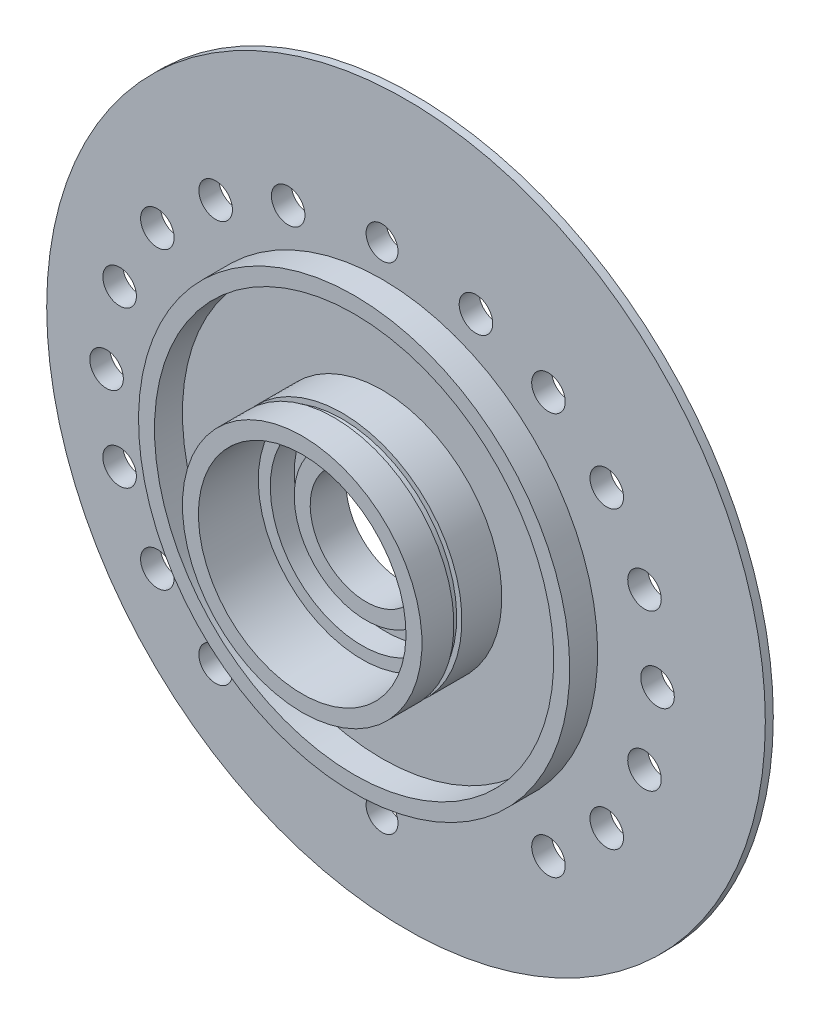
ISO-10303-21;
HEADER;
FILE_DESCRIPTION(('STEP AP214'),'2;1');
FILE_NAME('part.step','',(''),(''),'','','');
FILE_SCHEMA(('AUTOMOTIVE_DESIGN { 1 0 10303 214 1 1 1 1 }'));
ENDSEC;
DATA;
#1=APPLICATION_CONTEXT('core data for automotive mechanical design processes');
#2=APPLICATION_PROTOCOL_DEFINITION('international standard','automotive_design',2000,#1);
#3=PRODUCT_CONTEXT('',#1,'mechanical');
#4=PRODUCT('Part','Part','',(#3));
#5=PRODUCT_RELATED_PRODUCT_CATEGORY('part','',(#4));
#6=PRODUCT_DEFINITION_FORMATION('','',#4);
#7=PRODUCT_DEFINITION_CONTEXT('part definition',#1,'design');
#8=PRODUCT_DEFINITION('design','',#6,#7);
#9=PRODUCT_DEFINITION_SHAPE('','',#8);
#10=(LENGTH_UNIT() NAMED_UNIT(*) SI_UNIT(.MILLI.,.METRE.));
#11=(NAMED_UNIT(*) PLANE_ANGLE_UNIT() SI_UNIT($,.RADIAN.));
#12=(NAMED_UNIT(*) SI_UNIT($,.STERADIAN.) SOLID_ANGLE_UNIT());
#13=UNCERTAINTY_MEASURE_WITH_UNIT(LENGTH_MEASURE(1.E-05),#10,'distance_accuracy_value','');
#14=(GEOMETRIC_REPRESENTATION_CONTEXT(3) GLOBAL_UNCERTAINTY_ASSIGNED_CONTEXT((#13)) GLOBAL_UNIT_ASSIGNED_CONTEXT((#10,
#11,#12)) REPRESENTATION_CONTEXT('',''));
#15=CARTESIAN_POINT('',(0.,0.,0.));
#16=DIRECTION('',(0.,0.,1.));
#17=DIRECTION('',(1.,0.,0.));
#18=AXIS2_PLACEMENT_3D('',#15,#16,#17);
#19=CARTESIAN_POINT('',(0.,0.,-2.5));
#20=DIRECTION('',(0.,0.,-1.));
#21=DIRECTION('',(0.,1.,0.));
#22=AXIS2_PLACEMENT_3D('',#19,#20,#21);
#23=CYLINDRICAL_SURFACE('',#22,26.9999999999999);
#24=CARTESIAN_POINT('',(0.,0.,3.5));
#25=DIRECTION('',(0.,0.,-1.));
#26=DIRECTION('',(0.,1.,0.));
#27=AXIS2_PLACEMENT_3D('',#24,#25,#26);
#28=CIRCLE('',#27,26.9999999999999);
#29=CARTESIAN_POINT('',(0.,26.9999999999999,3.5));
#30=VERTEX_POINT('',#29);
#31=EDGE_CURVE('E43',#30,#30,#28,.T.);
#32=ORIENTED_EDGE('',*,*,#31,.T.);
#33=EDGE_LOOP('',(#32));
#34=FACE_BOUND('',#33,.T.);
#35=CARTESIAN_POINT('',(0.,0.,0.));
#36=DIRECTION('',(0.,0.,-1.));
#37=DIRECTION('',(0.,1.,0.));
#38=AXIS2_PLACEMENT_3D('',#35,#36,#37);
#39=CIRCLE('',#38,26.9999999999999);
#40=CARTESIAN_POINT('',(0.,26.9999999999999,0.));
#41=VERTEX_POINT('',#40);
#42=EDGE_CURVE('E61',#41,#41,#39,.T.);
#43=ORIENTED_EDGE('',*,*,#42,.F.);
#44=EDGE_LOOP('',(#43));
#45=FACE_BOUND('',#44,.T.);
#46=ADVANCED_FACE('F36',(#34,#45),#23,.T.);
#47=CARTESIAN_POINT('',(0.,26.9999999999999,3.5));
#48=DIRECTION('',(0.,0.,1.));
#49=DIRECTION('',(0.,-1.,0.));
#50=AXIS2_PLACEMENT_3D('',#47,#48,#49);
#51=PLANE('',#50);
#52=CARTESIAN_POINT('',(0.,0.,3.5));
#53=DIRECTION('',(0.,0.,-1.));
#54=DIRECTION('',(0.,1.,0.));
#55=AXIS2_PLACEMENT_3D('',#52,#53,#54);
#56=CIRCLE('',#55,24.9999999999999);
#57=CARTESIAN_POINT('',(0.,24.9999999999999,3.5));
#58=VERTEX_POINT('',#57);
#59=EDGE_CURVE('E48',#58,#58,#56,.T.);
#60=ORIENTED_EDGE('',*,*,#59,.T.);
#61=EDGE_LOOP('',(#60));
#62=FACE_BOUND('',#61,.T.);
#63=ORIENTED_EDGE('',*,*,#31,.F.);
#64=EDGE_LOOP('',(#63));
#65=FACE_BOUND('',#64,.T.);
#66=ADVANCED_FACE('F320',(#62,#65),#51,.T.);
#67=CARTESIAN_POINT('',(0.,0.,-2.5));
#68=DIRECTION('',(0.,0.,-1.));
#69=DIRECTION('',(0.,1.,0.));
#70=AXIS2_PLACEMENT_3D('',#67,#68,#69);
#71=CYLINDRICAL_SURFACE('',#70,24.9999999999999);
#72=CARTESIAN_POINT('',(0.,0.,0.));
#73=DIRECTION('',(0.,0.,-1.));
#74=DIRECTION('',(0.,1.,0.));
#75=AXIS2_PLACEMENT_3D('',#72,#73,#74);
#76=CIRCLE('',#75,24.9999999999999);
#77=CARTESIAN_POINT('',(0.,24.9999999999999,0.));
#78=VERTEX_POINT('',#77);
#79=EDGE_CURVE('E109',#78,#78,#76,.T.);
#80=ORIENTED_EDGE('',*,*,#79,.T.);
#81=EDGE_LOOP('',(#80));
#82=FACE_BOUND('',#81,.T.);
#83=ORIENTED_EDGE('',*,*,#59,.F.);
#84=EDGE_LOOP('',(#83));
#85=FACE_BOUND('',#84,.T.);
#86=ADVANCED_FACE('F314',(#82,#85),#71,.F.);
#87=CARTESIAN_POINT('',(0.,24.9999999999999,0.));
#88=DIRECTION('',(0.,0.,1.));
#89=DIRECTION('',(0.,-1.,0.));
#90=AXIS2_PLACEMENT_3D('',#87,#88,#89);
#91=PLANE('',#90);
#92=CARTESIAN_POINT('',(0.,0.,0.));
#93=DIRECTION('',(0.,0.,-1.));
#94=DIRECTION('',(0.,1.,0.));
#95=AXIS2_PLACEMENT_3D('',#92,#93,#94);
#96=CIRCLE('',#95,14.9999999999999);
#97=CARTESIAN_POINT('',(0.,14.9999999999999,0.));
#98=VERTEX_POINT('',#97);
#99=EDGE_CURVE('E106',#98,#98,#96,.T.);
#100=ORIENTED_EDGE('',*,*,#99,.T.);
#101=EDGE_LOOP('',(#100));
#102=FACE_BOUND('',#101,.T.);
#103=ORIENTED_EDGE('',*,*,#79,.F.);
#104=EDGE_LOOP('',(#103));
#105=FACE_BOUND('',#104,.T.);
#106=ADVANCED_FACE('F308',(#102,#105),#91,.T.);
#107=CARTESIAN_POINT('',(0.,0.,-2.5));
#108=DIRECTION('',(0.,0.,-1.));
#109=DIRECTION('',(0.,1.,0.));
#110=AXIS2_PLACEMENT_3D('',#107,#108,#109);
#111=CYLINDRICAL_SURFACE('',#110,14.9999999999999);
#112=CARTESIAN_POINT('',(0.,0.,5.));
#113=DIRECTION('',(0.,0.,-1.));
#114=DIRECTION('',(0.,1.,0.));
#115=AXIS2_PLACEMENT_3D('',#112,#113,#114);
#116=CIRCLE('',#115,14.9999999999999);
#117=CARTESIAN_POINT('',(0.,14.9999999999999,5.));
#118=VERTEX_POINT('',#117);
#119=EDGE_CURVE('E103',#118,#118,#116,.T.);
#120=ORIENTED_EDGE('',*,*,#119,.T.);
#121=EDGE_LOOP('',(#120));
#122=FACE_BOUND('',#121,.T.);
#123=ORIENTED_EDGE('',*,*,#99,.F.);
#124=EDGE_LOOP('',(#123));
#125=FACE_BOUND('',#124,.T.);
#126=ADVANCED_FACE('F302',(#122,#125),#111,.T.);
#127=CARTESIAN_POINT('',(0.,14.9999999999999,5.));
#128=DIRECTION('',(0.,0.,1.));
#129=DIRECTION('',(0.,-1.,0.));
#130=AXIS2_PLACEMENT_3D('',#127,#128,#129);
#131=PLANE('',#130);
#132=CARTESIAN_POINT('',(0.,0.,5.));
#133=DIRECTION('',(0.,0.,-1.));
#134=DIRECTION('',(0.,1.,0.));
#135=AXIS2_PLACEMENT_3D('',#132,#133,#134);
#136=CIRCLE('',#135,14.3499999999999);
#137=CARTESIAN_POINT('',(0.,14.3499999999999,5.));
#138=VERTEX_POINT('',#137);
#139=EDGE_CURVE('E100',#138,#138,#136,.T.);
#140=ORIENTED_EDGE('',*,*,#139,.T.);
#141=EDGE_LOOP('',(#140));
#142=FACE_BOUND('',#141,.T.);
#143=ORIENTED_EDGE('',*,*,#119,.F.);
#144=EDGE_LOOP('',(#143));
#145=FACE_BOUND('',#144,.T.);
#146=ADVANCED_FACE('F296',(#142,#145),#131,.T.);
#147=CARTESIAN_POINT('',(0.,0.,-2.5));
#148=DIRECTION('',(0.,0.,-1.));
#149=DIRECTION('',(0.,1.,0.));
#150=AXIS2_PLACEMENT_3D('',#147,#148,#149);
#151=CYLINDRICAL_SURFACE('',#150,14.3499999999999);
#152=CARTESIAN_POINT('',(0.,0.,6.));
#153=DIRECTION('',(0.,0.,-1.));
#154=DIRECTION('',(0.,1.,0.));
#155=AXIS2_PLACEMENT_3D('',#152,#153,#154);
#156=CIRCLE('',#155,14.3499999999999);
#157=CARTESIAN_POINT('',(0.,14.3499999999999,6.));
#158=VERTEX_POINT('',#157);
#159=EDGE_CURVE('E97',#158,#158,#156,.T.);
#160=ORIENTED_EDGE('',*,*,#159,.T.);
#161=EDGE_LOOP('',(#160));
#162=FACE_BOUND('',#161,.T.);
#163=ORIENTED_EDGE('',*,*,#139,.F.);
#164=EDGE_LOOP('',(#163));
#165=FACE_BOUND('',#164,.T.);
#166=ADVANCED_FACE('F290',(#162,#165),#151,.T.);
#167=CARTESIAN_POINT('',(0.,14.3499999999999,6.));
#168=DIRECTION('',(0.,0.,-1.));
#169=DIRECTION('',(0.,1.,0.));
#170=AXIS2_PLACEMENT_3D('',#167,#168,#169);
#171=PLANE('',#170);
#172=CARTESIAN_POINT('',(0.,0.,6.));
#173=DIRECTION('',(0.,0.,-1.));
#174=DIRECTION('',(0.,1.,0.));
#175=AXIS2_PLACEMENT_3D('',#172,#173,#174);
#176=CIRCLE('',#175,14.9999999999999);
#177=CARTESIAN_POINT('',(0.,14.9999999999999,6.));
#178=VERTEX_POINT('',#177);
#179=EDGE_CURVE('E94',#178,#178,#176,.T.);
#180=ORIENTED_EDGE('',*,*,#179,.T.);
#181=EDGE_LOOP('',(#180));
#182=FACE_BOUND('',#181,.T.);
#183=ORIENTED_EDGE('',*,*,#159,.F.);
#184=EDGE_LOOP('',(#183));
#185=FACE_BOUND('',#184,.T.);
#186=ADVANCED_FACE('F284',(#182,#185),#171,.T.);
#187=CARTESIAN_POINT('',(0.,0.,-2.5));
#188=DIRECTION('',(0.,0.,-1.));
#189=DIRECTION('',(0.,1.,0.));
#190=AXIS2_PLACEMENT_3D('',#187,#188,#189);
#191=CYLINDRICAL_SURFACE('',#190,14.9999999999999);
#192=CARTESIAN_POINT('',(0.,0.,10.));
#193=DIRECTION('',(0.,0.,-1.));
#194=DIRECTION('',(0.,1.,0.));
#195=AXIS2_PLACEMENT_3D('',#192,#193,#194);
#196=CIRCLE('',#195,14.9999999999999);
#197=CARTESIAN_POINT('',(0.,14.9999999999999,10.));
#198=VERTEX_POINT('',#197);
#199=EDGE_CURVE('E91',#198,#198,#196,.T.);
#200=ORIENTED_EDGE('',*,*,#199,.T.);
#201=EDGE_LOOP('',(#200));
#202=FACE_BOUND('',#201,.T.);
#203=ORIENTED_EDGE('',*,*,#179,.F.);
#204=EDGE_LOOP('',(#203));
#205=FACE_BOUND('',#204,.T.);
#206=ADVANCED_FACE('F278',(#202,#205),#191,.T.);
#207=CARTESIAN_POINT('',(0.,14.9999999999999,10.));
#208=DIRECTION('',(0.,0.,1.));
#209=DIRECTION('',(0.,-1.,0.));
#210=AXIS2_PLACEMENT_3D('',#207,#208,#209);
#211=PLANE('',#210);
#212=CARTESIAN_POINT('',(0.,0.,10.));
#213=DIRECTION('',(0.,0.,-1.));
#214=DIRECTION('',(0.,1.,0.));
#215=AXIS2_PLACEMENT_3D('',#212,#213,#214);
#216=CIRCLE('',#215,12.9999999999999);
#217=CARTESIAN_POINT('',(0.,12.9999999999999,10.));
#218=VERTEX_POINT('',#217);
#219=EDGE_CURVE('E88',#218,#218,#216,.T.);
#220=ORIENTED_EDGE('',*,*,#219,.T.);
#221=EDGE_LOOP('',(#220));
#222=FACE_BOUND('',#221,.T.);
#223=ORIENTED_EDGE('',*,*,#199,.F.);
#224=EDGE_LOOP('',(#223));
#225=FACE_BOUND('',#224,.T.);
#226=ADVANCED_FACE('F272',(#222,#225),#211,.T.);
#227=CARTESIAN_POINT('',(0.,0.,-2.5));
#228=DIRECTION('',(0.,0.,-1.));
#229=DIRECTION('',(0.,1.,0.));
#230=AXIS2_PLACEMENT_3D('',#227,#228,#229);
#231=CYLINDRICAL_SURFACE('',#230,12.9999999999999);
#232=CARTESIAN_POINT('',(0.,0.,2.5));
#233=DIRECTION('',(0.,0.,-1.));
#234=DIRECTION('',(0.,1.,0.));
#235=AXIS2_PLACEMENT_3D('',#232,#233,#234);
#236=CIRCLE('',#235,12.9999999999999);
#237=CARTESIAN_POINT('',(0.,12.9999999999999,2.5));
#238=VERTEX_POINT('',#237);
#239=EDGE_CURVE('E85',#238,#238,#236,.T.);
#240=ORIENTED_EDGE('',*,*,#239,.T.);
#241=EDGE_LOOP('',(#240));
#242=FACE_BOUND('',#241,.T.);
#243=ORIENTED_EDGE('',*,*,#219,.F.);
#244=EDGE_LOOP('',(#243));
#245=FACE_BOUND('',#244,.T.);
#246=ADVANCED_FACE('F266',(#242,#245),#231,.F.);
#247=CARTESIAN_POINT('',(0.,12.9999999999999,2.5));
#248=DIRECTION('',(0.,0.,1.));
#249=DIRECTION('',(0.,-1.,0.));
#250=AXIS2_PLACEMENT_3D('',#247,#248,#249);
#251=PLANE('',#250);
#252=CARTESIAN_POINT('',(0.,0.,2.5));
#253=DIRECTION('',(0.,0.,-1.));
#254=DIRECTION('',(0.,1.,0.));
#255=AXIS2_PLACEMENT_3D('',#252,#253,#254);
#256=CIRCLE('',#255,11.4999999999999);
#257=CARTESIAN_POINT('',(0.,11.4999999999999,2.5));
#258=VERTEX_POINT('',#257);
#259=EDGE_CURVE('E82',#258,#258,#256,.T.);
#260=ORIENTED_EDGE('',*,*,#259,.T.);
#261=EDGE_LOOP('',(#260));
#262=FACE_BOUND('',#261,.T.);
#263=ORIENTED_EDGE('',*,*,#239,.F.);
#264=EDGE_LOOP('',(#263));
#265=FACE_BOUND('',#264,.T.);
#266=ADVANCED_FACE('F260',(#262,#265),#251,.T.);
#267=CARTESIAN_POINT('',(0.,0.,-2.5));
#268=DIRECTION('',(0.,0.,-1.));
#269=DIRECTION('',(0.,1.,0.));
#270=AXIS2_PLACEMENT_3D('',#267,#268,#269);
#271=CYLINDRICAL_SURFACE('',#270,11.4999999999999);
#272=CARTESIAN_POINT('',(0.,0.,-0.499999999999998));
#273=DIRECTION('',(0.,0.,-1.));
#274=DIRECTION('',(0.,1.,0.));
#275=AXIS2_PLACEMENT_3D('',#272,#273,#274);
#276=CIRCLE('',#275,11.4999999999999);
#277=CARTESIAN_POINT('',(0.,11.4999999999999,-0.499999999999998));
#278=VERTEX_POINT('',#277);
#279=EDGE_CURVE('E79',#278,#278,#276,.T.);
#280=ORIENTED_EDGE('',*,*,#279,.T.);
#281=EDGE_LOOP('',(#280));
#282=FACE_BOUND('',#281,.T.);
#283=ORIENTED_EDGE('',*,*,#259,.F.);
#284=EDGE_LOOP('',(#283));
#285=FACE_BOUND('',#284,.T.);
#286=ADVANCED_FACE('F254',(#282,#285),#271,.F.);
#287=CARTESIAN_POINT('',(0.,11.4999999999999,-0.499999999999998));
#288=DIRECTION('',(0.,0.,1.));
#289=DIRECTION('',(0.,-1.,0.));
#290=AXIS2_PLACEMENT_3D('',#287,#288,#289);
#291=PLANE('',#290);
#292=CARTESIAN_POINT('',(0.,0.,-0.499999999999999));
#293=DIRECTION('',(0.,0.,-1.));
#294=DIRECTION('',(0.,1.,0.));
#295=AXIS2_PLACEMENT_3D('',#292,#293,#294);
#296=CIRCLE('',#295,8.99999999999994);
#297=CARTESIAN_POINT('',(0.,8.99999999999994,-0.499999999999999));
#298=VERTEX_POINT('',#297);
#299=EDGE_CURVE('E76',#298,#298,#296,.T.);
#300=ORIENTED_EDGE('',*,*,#299,.T.);
#301=EDGE_LOOP('',(#300));
#302=FACE_BOUND('',#301,.T.);
#303=ORIENTED_EDGE('',*,*,#279,.F.);
#304=EDGE_LOOP('',(#303));
#305=FACE_BOUND('',#304,.T.);
#306=ADVANCED_FACE('F248',(#302,#305),#291,.T.);
#307=CARTESIAN_POINT('',(0.,0.,-2.5));
#308=DIRECTION('',(0.,0.,-1.));
#309=DIRECTION('',(0.,1.,0.));
#310=AXIS2_PLACEMENT_3D('',#307,#308,#309);
#311=CYLINDRICAL_SURFACE('',#310,8.99999999999994);
#312=CARTESIAN_POINT('',(0.,0.,2.));
#313=DIRECTION('',(0.,0.,-1.));
#314=DIRECTION('',(0.,1.,0.));
#315=AXIS2_PLACEMENT_3D('',#312,#313,#314);
#316=CIRCLE('',#315,8.99999999999994);
#317=CARTESIAN_POINT('',(0.,8.99999999999994,2.));
#318=VERTEX_POINT('',#317);
#319=EDGE_CURVE('E73',#318,#318,#316,.T.);
#320=ORIENTED_EDGE('',*,*,#319,.T.);
#321=EDGE_LOOP('',(#320));
#322=FACE_BOUND('',#321,.T.);
#323=ORIENTED_EDGE('',*,*,#299,.F.);
#324=EDGE_LOOP('',(#323));
#325=FACE_BOUND('',#324,.T.);
#326=ADVANCED_FACE('F242',(#322,#325),#311,.T.);
#327=CARTESIAN_POINT('',(0.,8.99999999999994,2.));
#328=DIRECTION('',(0.,0.,1.));
#329=DIRECTION('',(0.,-1.,0.));
#330=AXIS2_PLACEMENT_3D('',#327,#328,#329);
#331=PLANE('',#330);
#332=CARTESIAN_POINT('',(0.,0.,2.));
#333=DIRECTION('',(0.,0.,-1.));
#334=DIRECTION('',(0.,1.,0.));
#335=AXIS2_PLACEMENT_3D('',#332,#333,#334);
#336=CIRCLE('',#335,6.99999999999995);
#337=CARTESIAN_POINT('',(0.,6.99999999999995,2.));
#338=VERTEX_POINT('',#337);
#339=EDGE_CURVE('E70',#338,#338,#336,.T.);
#340=ORIENTED_EDGE('',*,*,#339,.T.);
#341=EDGE_LOOP('',(#340));
#342=FACE_BOUND('',#341,.T.);
#343=ORIENTED_EDGE('',*,*,#319,.F.);
#344=EDGE_LOOP('',(#343));
#345=FACE_BOUND('',#344,.T.);
#346=ADVANCED_FACE('F236',(#342,#345),#331,.T.);
#347=CARTESIAN_POINT('',(0.,0.,-2.5));
#348=DIRECTION('',(0.,0.,-1.));
#349=DIRECTION('',(0.,1.,0.));
#350=AXIS2_PLACEMENT_3D('',#347,#348,#349);
#351=CYLINDRICAL_SURFACE('',#350,6.99999999999995);
#352=CARTESIAN_POINT('',(0.,0.,-2.5));
#353=DIRECTION('',(0.,0.,-1.));
#354=DIRECTION('',(0.,1.,0.));
#355=AXIS2_PLACEMENT_3D('',#352,#353,#354);
#356=CIRCLE('',#355,6.99999999999995);
#357=CARTESIAN_POINT('',(0.,6.99999999999995,-2.5));
#358=VERTEX_POINT('',#357);
#359=EDGE_CURVE('E67',#358,#358,#356,.T.);
#360=ORIENTED_EDGE('',*,*,#359,.T.);
#361=EDGE_LOOP('',(#360));
#362=FACE_BOUND('',#361,.T.);
#363=ORIENTED_EDGE('',*,*,#339,.F.);
#364=EDGE_LOOP('',(#363));
#365=FACE_BOUND('',#364,.T.);
#366=ADVANCED_FACE('F224',(#362,#365),#351,.F.);
#367=CARTESIAN_POINT('',(0.,37.5,-2.5));
#368=DIRECTION('',(0.,0.,-1.));
#369=DIRECTION('',(0.,1.,0.));
#370=AXIS2_PLACEMENT_3D('',#367,#368,#369);
#371=PLANE('',#370);
#372=CARTESIAN_POINT('',(0.,-31.,-2.5));
#373=DIRECTION('',(0.,0.,-1.));
#374=DIRECTION('',(-1.,0.,0.));
#375=AXIS2_PLACEMENT_3D('',#372,#373,#374);
#376=CIRCLE('',#375,2.);
#377=CARTESIAN_POINT('',(-2.,-31.,-2.5));
#378=VERTEX_POINT('',#377);
#379=EDGE_CURVE('E187',#378,#378,#376,.T.);
#380=ORIENTED_EDGE('',*,*,#379,.F.);
#381=EDGE_LOOP('',(#380));
#382=FACE_BOUND('',#381,.T.);
#383=CARTESIAN_POINT('',(0.,31.,-2.5));
#384=DIRECTION('',(0.,0.,-1.));
#385=DIRECTION('',(-1.,0.,0.));
#386=AXIS2_PLACEMENT_3D('',#383,#384,#385);
#387=CIRCLE('',#386,2.);
#388=CARTESIAN_POINT('',(-2.,31.,-2.5));
#389=VERTEX_POINT('',#388);
#390=EDGE_CURVE('E177',#389,#389,#387,.T.);
#391=ORIENTED_EDGE('',*,*,#390,.F.);
#392=EDGE_LOOP('',(#391));
#393=FACE_BOUND('',#392,.T.);
#394=CARTESIAN_POINT('',(-20.8391710504508,-25.1601170383628,-2.5));
#395=DIRECTION('',(0.,0.,-1.));
#396=DIRECTION('',(-0.544639035015025,-0.838670567945425,0.));
#397=AXIS2_PLACEMENT_3D('',#394,#395,#396);
#398=CIRCLE('',#397,2.1);
#399=CARTESIAN_POINT('',(-21.9829130239823,-26.9213252310482,-2.5));
#400=VERTEX_POINT('',#399);
#401=EDGE_CURVE('E174',#400,#400,#398,.T.);
#402=ORIENTED_EDGE('',*,*,#401,.F.);
#403=EDGE_LOOP('',(#402));
#404=FACE_BOUND('',#403,.T.);
#405=CARTESIAN_POINT('',(-28.1403226082016,-18.4698442597698,-2.5));
#406=DIRECTION('',(0.,0.,-1.));
#407=DIRECTION('',(-0.788010753606721,-0.61566147532566,0.));
#408=AXIS2_PLACEMENT_3D('',#405,#406,#407);
#409=CIRCLE('',#408,2.1);
#410=CARTESIAN_POINT('',(-29.7951451907758,-19.7627333579537,-2.5));
#411=VERTEX_POINT('',#410);
#412=EDGE_CURVE('E171',#411,#411,#409,.T.);
#413=ORIENTED_EDGE('',*,*,#412,.F.);
#414=EDGE_LOOP('',(#413));
#415=FACE_BOUND('',#414,.T.);
#416=CARTESIAN_POINT('',(-32.8655572679795,-9.76704463371472,-2.5));
#417=DIRECTION('',(0.,0.,-1.));
#418=DIRECTION('',(-0.945518575599317,-0.325568154457157,0.));
#419=AXIS2_PLACEMENT_3D('',#416,#417,#418);
#420=CIRCLE('',#419,2.1);
#421=CARTESIAN_POINT('',(-34.8511462767381,-10.4507377580748,-2.5));
#422=VERTEX_POINT('',#421);
#423=EDGE_CURVE('E167',#422,#422,#420,.T.);
#424=ORIENTED_EDGE('',*,*,#423,.F.);
#425=EDGE_LOOP('',(#424));
#426=FACE_BOUND('',#425,.T.);
#427=CARTESIAN_POINT('',(-11.7576568679899,29.1088717882799,-2.5));
#428=DIRECTION('',(0.,0.,-1.));
#429=DIRECTION('',(-0.241921895599665,0.970295726275997,0.));
#430=AXIS2_PLACEMENT_3D('',#427,#428,#429);
#431=CIRCLE('',#430,2.1);
#432=CARTESIAN_POINT('',(-12.2656928487492,31.1464928134595,-2.5));
#433=VERTEX_POINT('',#432);
#434=EDGE_CURVE('E163',#433,#433,#431,.T.);
#435=ORIENTED_EDGE('',*,*,#434,.F.);
#436=EDGE_LOOP('',(#435));
#437=FACE_BOUND('',#436,.T.);
#438=CARTESIAN_POINT('',(-20.8391710504508,25.1601170383628,-2.5));
#439=DIRECTION('',(0.,0.,-1.));
#440=DIRECTION('',(-0.544639035015025,0.838670567945425,0.));
#441=AXIS2_PLACEMENT_3D('',#438,#439,#440);
#442=CIRCLE('',#441,2.1);
#443=CARTESIAN_POINT('',(-21.9829130239823,26.9213252310482,-2.5));
#444=VERTEX_POINT('',#443);
#445=EDGE_CURVE('E159',#444,#444,#442,.T.);
#446=ORIENTED_EDGE('',*,*,#445,.F.);
#447=EDGE_LOOP('',(#446));
#448=FACE_BOUND('',#447,.T.);
#449=CARTESIAN_POINT('',(-28.1403226082016,18.4698442597698,-2.5));
#450=DIRECTION('',(0.,0.,-1.));
#451=DIRECTION('',(-0.788010753606721,0.61566147532566,0.));
#452=AXIS2_PLACEMENT_3D('',#449,#450,#451);
#453=CIRCLE('',#452,2.1);
#454=CARTESIAN_POINT('',(-29.7951451907758,19.7627333579537,-2.5));
#455=VERTEX_POINT('',#454);
#456=EDGE_CURVE('E155',#455,#455,#453,.T.);
#457=ORIENTED_EDGE('',*,*,#456,.F.);
#458=EDGE_LOOP('',(#457));
#459=FACE_BOUND('',#458,.T.);
#460=CARTESIAN_POINT('',(-32.8655572679795,9.76704463371472,-2.5));
#461=DIRECTION('',(0.,0.,-1.));
#462=DIRECTION('',(-0.945518575599317,0.325568154457157,0.));
#463=AXIS2_PLACEMENT_3D('',#460,#461,#462);
#464=CIRCLE('',#463,2.1);
#465=CARTESIAN_POINT('',(-34.8511462767381,10.4507377580748,-2.5));
#466=VERTEX_POINT('',#465);
#467=EDGE_CURVE('E151',#466,#466,#464,.T.);
#468=ORIENTED_EDGE('',*,*,#467,.F.);
#469=EDGE_LOOP('',(#468));
#470=FACE_BOUND('',#469,.T.);
#471=CARTESIAN_POINT('',(-34.5,0.,-2.5));
#472=DIRECTION('',(0.,0.,-1.));
#473=DIRECTION('',(-1.,0.,0.));
#474=AXIS2_PLACEMENT_3D('',#471,#472,#473);
#475=CIRCLE('',#474,2.1);
#476=CARTESIAN_POINT('',(-36.6,0.,-2.5));
#477=VERTEX_POINT('',#476);
#478=EDGE_CURVE('E147',#477,#477,#475,.T.);
#479=ORIENTED_EDGE('',*,*,#478,.F.);
#480=EDGE_LOOP('',(#479));
#481=FACE_BOUND('',#480,.T.);
#482=CARTESIAN_POINT('',(20.8391710504508,-25.1601170383628,-2.5));
#483=DIRECTION('',(0.,0.,-1.));
#484=DIRECTION('',(-0.544639035015025,0.838670567945425,0.));
#485=AXIS2_PLACEMENT_3D('',#482,#483,#484);
#486=CIRCLE('',#485,2.1);
#487=CARTESIAN_POINT('',(19.6954290769192,-23.3989088456774,-2.5));
#488=VERTEX_POINT('',#487);
#489=EDGE_CURVE('E143',#488,#488,#486,.T.);
#490=ORIENTED_EDGE('',*,*,#489,.F.);
#491=EDGE_LOOP('',(#490));
#492=FACE_BOUND('',#491,.T.);
#493=CARTESIAN_POINT('',(28.1403226082016,-18.4698442597698,-2.5));
#494=DIRECTION('',(0.,0.,-1.));
#495=DIRECTION('',(-0.788010753606721,0.61566147532566,0.));
#496=AXIS2_PLACEMENT_3D('',#493,#494,#495);
#497=CIRCLE('',#496,2.1);
#498=CARTESIAN_POINT('',(26.4855000256275,-17.1769551615859,-2.5));
#499=VERTEX_POINT('',#498);
#500=EDGE_CURVE('E139',#499,#499,#497,.T.);
#501=ORIENTED_EDGE('',*,*,#500,.F.);
#502=EDGE_LOOP('',(#501));
#503=FACE_BOUND('',#502,.T.);
#504=CARTESIAN_POINT('',(32.8655572679795,-9.76704463371472,-2.5));
#505=DIRECTION('',(0.,0.,-1.));
#506=DIRECTION('',(-0.945518575599317,0.325568154457157,0.));
#507=AXIS2_PLACEMENT_3D('',#504,#505,#506);
#508=CIRCLE('',#507,2.1);
#509=CARTESIAN_POINT('',(30.8799682592209,-9.08335150935469,-2.5));
#510=VERTEX_POINT('',#509);
#511=EDGE_CURVE('E135',#510,#510,#508,.T.);
#512=ORIENTED_EDGE('',*,*,#511,.F.);
#513=EDGE_LOOP('',(#512));
#514=FACE_BOUND('',#513,.T.);
#515=CARTESIAN_POINT('',(11.7576568679899,29.1088717882799,-2.5));
#516=DIRECTION('',(0.,0.,-1.));
#517=DIRECTION('',(-0.241921895599665,-0.970295726275997,0.));
#518=AXIS2_PLACEMENT_3D('',#515,#516,#517);
#519=CIRCLE('',#518,2.1);
#520=CARTESIAN_POINT('',(11.2496208872307,27.0712507631003,-2.5));
#521=VERTEX_POINT('',#520);
#522=EDGE_CURVE('E131',#521,#521,#519,.T.);
#523=ORIENTED_EDGE('',*,*,#522,.F.);
#524=EDGE_LOOP('',(#523));
#525=FACE_BOUND('',#524,.T.);
#526=CARTESIAN_POINT('',(20.8391710504508,25.1601170383628,-2.5));
#527=DIRECTION('',(0.,0.,-1.));
#528=DIRECTION('',(-0.544639035015025,-0.838670567945425,0.));
#529=AXIS2_PLACEMENT_3D('',#526,#527,#528);
#530=CIRCLE('',#529,2.1);
#531=CARTESIAN_POINT('',(19.6954290769192,23.3989088456774,-2.5));
#532=VERTEX_POINT('',#531);
#533=EDGE_CURVE('E127',#532,#532,#530,.T.);
#534=ORIENTED_EDGE('',*,*,#533,.F.);
#535=EDGE_LOOP('',(#534));
#536=FACE_BOUND('',#535,.T.);
#537=CARTESIAN_POINT('',(28.1403226082016,18.4698442597698,-2.5));
#538=DIRECTION('',(0.,0.,-1.));
#539=DIRECTION('',(-0.788010753606721,-0.61566147532566,0.));
#540=AXIS2_PLACEMENT_3D('',#537,#538,#539);
#541=CIRCLE('',#540,2.1);
#542=CARTESIAN_POINT('',(26.4855000256275,17.1769551615859,-2.5));
#543=VERTEX_POINT('',#542);
#544=EDGE_CURVE('E123',#543,#543,#541,.T.);
#545=ORIENTED_EDGE('',*,*,#544,.F.);
#546=EDGE_LOOP('',(#545));
#547=FACE_BOUND('',#546,.T.);
#548=CARTESIAN_POINT('',(32.8655572679795,9.76704463371472,-2.5));
#549=DIRECTION('',(0.,0.,-1.));
#550=DIRECTION('',(-0.945518575599317,-0.325568154457157,0.));
#551=AXIS2_PLACEMENT_3D('',#548,#549,#550);
#552=CIRCLE('',#551,2.1);
#553=CARTESIAN_POINT('',(30.8799682592209,9.08335150935469,-2.5));
#554=VERTEX_POINT('',#553);
#555=EDGE_CURVE('E119',#554,#554,#552,.T.);
#556=ORIENTED_EDGE('',*,*,#555,.F.);
#557=EDGE_LOOP('',(#556));
#558=FACE_BOUND('',#557,.T.);
#559=CARTESIAN_POINT('',(34.5,0.,-2.5));
#560=DIRECTION('',(0.,0.,-1.));
#561=DIRECTION('',(-1.,0.,0.));
#562=AXIS2_PLACEMENT_3D('',#559,#560,#561);
#563=CIRCLE('',#562,2.1);
#564=CARTESIAN_POINT('',(32.4,0.,-2.5));
#565=VERTEX_POINT('',#564);
#566=EDGE_CURVE('E52',#565,#565,#563,.T.);
#567=ORIENTED_EDGE('',*,*,#566,.F.);
#568=EDGE_LOOP('',(#567));
#569=FACE_BOUND('',#568,.T.);
#570=CARTESIAN_POINT('',(0.,0.,-2.5));
#571=DIRECTION('',(0.,0.,-1.));
#572=DIRECTION('',(0.,1.,0.));
#573=AXIS2_PLACEMENT_3D('',#570,#571,#572);
#574=CIRCLE('',#573,37.5);
#575=CARTESIAN_POINT('',(0.,37.5,-2.5));
#576=VERTEX_POINT('',#575);
#577=EDGE_CURVE('E64',#576,#576,#574,.T.);
#578=ORIENTED_EDGE('',*,*,#577,.T.);
#579=EDGE_LOOP('',(#578));
#580=FACE_BOUND('',#579,.T.);
#581=ORIENTED_EDGE('',*,*,#359,.F.);
#582=EDGE_LOOP('',(#581));
#583=FACE_BOUND('',#582,.T.);
#584=ADVANCED_FACE('F220',(#382,#393,#404,#415,#426,#437,#448,#459,#470,#481,#492,#503,#514,
#525,#536,#547,#558,#569,#580,#583),#371,.T.);
#585=CARTESIAN_POINT('',(0.,0.,-2.5));
#586=DIRECTION('',(0.,0.,-1.));
#587=DIRECTION('',(0.,1.,0.));
#588=AXIS2_PLACEMENT_3D('',#585,#586,#587);
#589=CYLINDRICAL_SURFACE('',#588,37.5);
#590=CARTESIAN_POINT('',(0.,0.,-1.));
#591=DIRECTION('',(0.,0.,1.));
#592=DIRECTION('',(1.,0.,0.));
#593=AXIS2_PLACEMENT_3D('',#590,#591,#592);
#594=CIRCLE('',#593,37.5);
#595=CARTESIAN_POINT('',(37.5,0.,-1.));
#596=VERTEX_POINT('',#595);
#597=EDGE_CURVE('E12',#596,#596,#594,.T.);
#598=ORIENTED_EDGE('',*,*,#597,.F.);
#599=EDGE_LOOP('',(#598));
#600=FACE_BOUND('',#599,.T.);
#601=ORIENTED_EDGE('',*,*,#577,.F.);
#602=EDGE_LOOP('',(#601));
#603=FACE_BOUND('',#602,.T.);
#604=ADVANCED_FACE('F223',(#600,#603),#589,.T.);
#605=CARTESIAN_POINT('',(0.,37.5,0.));
#606=DIRECTION('',(0.,0.,1.));
#607=DIRECTION('',(0.,-1.,0.));
#608=AXIS2_PLACEMENT_3D('',#605,#606,#607);
#609=PLANE('',#608);
#610=CARTESIAN_POINT('',(0.,-31.,0.));
#611=DIRECTION('',(0.,0.,1.));
#612=DIRECTION('',(1.,0.,0.));
#613=AXIS2_PLACEMENT_3D('',#610,#611,#612);
#614=CIRCLE('',#613,2.);
#615=CARTESIAN_POINT('',(2.,-31.,0.));
#616=VERTEX_POINT('',#615);
#617=EDGE_CURVE('E39',#616,#616,#614,.T.);
#618=ORIENTED_EDGE('',*,*,#617,.F.);
#619=EDGE_LOOP('',(#618));
#620=FACE_BOUND('',#619,.T.);
#621=CARTESIAN_POINT('',(0.,31.,0.));
#622=DIRECTION('',(0.,0.,1.));
#623=DIRECTION('',(1.,0.,0.));
#624=AXIS2_PLACEMENT_3D('',#621,#622,#623);
#625=CIRCLE('',#624,2.);
#626=CARTESIAN_POINT('',(2.,31.,0.));
#627=VERTEX_POINT('',#626);
#628=EDGE_CURVE('E175',#627,#627,#625,.T.);
#629=ORIENTED_EDGE('',*,*,#628,.F.);
#630=EDGE_LOOP('',(#629));
#631=FACE_BOUND('',#630,.T.);
#632=CARTESIAN_POINT('',(-20.8391710504508,-25.1601170383628,0.));
#633=DIRECTION('',(0.,0.,1.));
#634=DIRECTION('',(1.,0.,0.));
#635=AXIS2_PLACEMENT_3D('',#632,#633,#634);
#636=CIRCLE('',#635,2.1);
#637=CARTESIAN_POINT('',(-18.7391710504508,-25.1601170383628,0.));
#638=VERTEX_POINT('',#637);
#639=EDGE_CURVE('E172',#638,#638,#636,.T.);
#640=ORIENTED_EDGE('',*,*,#639,.F.);
#641=EDGE_LOOP('',(#640));
#642=FACE_BOUND('',#641,.T.);
#643=CARTESIAN_POINT('',(-28.1403226082016,-18.4698442597698,0.));
#644=DIRECTION('',(0.,0.,1.));
#645=DIRECTION('',(1.,0.,0.));
#646=AXIS2_PLACEMENT_3D('',#643,#644,#645);
#647=CIRCLE('',#646,2.1);
#648=CARTESIAN_POINT('',(-26.0403226082016,-18.4698442597698,0.));
#649=VERTEX_POINT('',#648);
#650=EDGE_CURVE('E168',#649,#649,#647,.T.);
#651=ORIENTED_EDGE('',*,*,#650,.F.);
#652=EDGE_LOOP('',(#651));
#653=FACE_BOUND('',#652,.T.);
#654=CARTESIAN_POINT('',(-32.8655572679795,-9.76704463371472,0.));
#655=DIRECTION('',(0.,0.,1.));
#656=DIRECTION('',(1.,0.,0.));
#657=AXIS2_PLACEMENT_3D('',#654,#655,#656);
#658=CIRCLE('',#657,2.1);
#659=CARTESIAN_POINT('',(-30.7655572679795,-9.76704463371472,0.));
#660=VERTEX_POINT('',#659);
#661=EDGE_CURVE('E164',#660,#660,#658,.T.);
#662=ORIENTED_EDGE('',*,*,#661,.F.);
#663=EDGE_LOOP('',(#662));
#664=FACE_BOUND('',#663,.T.);
#665=CARTESIAN_POINT('',(-11.7576568679899,29.1088717882799,0.));
#666=DIRECTION('',(0.,0.,1.));
#667=DIRECTION('',(1.,0.,0.));
#668=AXIS2_PLACEMENT_3D('',#665,#666,#667);
#669=CIRCLE('',#668,2.1);
#670=CARTESIAN_POINT('',(-9.65765686798995,29.1088717882799,0.));
#671=VERTEX_POINT('',#670);
#672=EDGE_CURVE('E160',#671,#671,#669,.T.);
#673=ORIENTED_EDGE('',*,*,#672,.F.);
#674=EDGE_LOOP('',(#673));
#675=FACE_BOUND('',#674,.T.);
#676=CARTESIAN_POINT('',(-20.8391710504508,25.1601170383628,0.));
#677=DIRECTION('',(0.,0.,1.));
#678=DIRECTION('',(1.,0.,0.));
#679=AXIS2_PLACEMENT_3D('',#676,#677,#678);
#680=CIRCLE('',#679,2.1);
#681=CARTESIAN_POINT('',(-18.7391710504508,25.1601170383628,0.));
#682=VERTEX_POINT('',#681);
#683=EDGE_CURVE('E156',#682,#682,#680,.T.);
#684=ORIENTED_EDGE('',*,*,#683,.F.);
#685=EDGE_LOOP('',(#684));
#686=FACE_BOUND('',#685,.T.);
#687=CARTESIAN_POINT('',(-28.1403226082016,18.4698442597698,0.));
#688=DIRECTION('',(0.,0.,1.));
#689=DIRECTION('',(1.,0.,0.));
#690=AXIS2_PLACEMENT_3D('',#687,#688,#689);
#691=CIRCLE('',#690,2.1);
#692=CARTESIAN_POINT('',(-26.0403226082016,18.4698442597698,0.));
#693=VERTEX_POINT('',#692);
#694=EDGE_CURVE('E152',#693,#693,#691,.T.);
#695=ORIENTED_EDGE('',*,*,#694,.F.);
#696=EDGE_LOOP('',(#695));
#697=FACE_BOUND('',#696,.T.);
#698=CARTESIAN_POINT('',(-32.8655572679795,9.76704463371472,0.));
#699=DIRECTION('',(0.,0.,1.));
#700=DIRECTION('',(1.,0.,0.));
#701=AXIS2_PLACEMENT_3D('',#698,#699,#700);
#702=CIRCLE('',#701,2.1);
#703=CARTESIAN_POINT('',(-30.7655572679795,9.76704463371472,0.));
#704=VERTEX_POINT('',#703);
#705=EDGE_CURVE('E148',#704,#704,#702,.T.);
#706=ORIENTED_EDGE('',*,*,#705,.F.);
#707=EDGE_LOOP('',(#706));
#708=FACE_BOUND('',#707,.T.);
#709=CARTESIAN_POINT('',(-34.5,0.,0.));
#710=DIRECTION('',(0.,0.,1.));
#711=DIRECTION('',(1.,0.,0.));
#712=AXIS2_PLACEMENT_3D('',#709,#710,#711);
#713=CIRCLE('',#712,2.1);
#714=CARTESIAN_POINT('',(-32.4,0.,0.));
#715=VERTEX_POINT('',#714);
#716=EDGE_CURVE('E144',#715,#715,#713,.T.);
#717=ORIENTED_EDGE('',*,*,#716,.F.);
#718=EDGE_LOOP('',(#717));
#719=FACE_BOUND('',#718,.T.);
#720=CARTESIAN_POINT('',(20.8391710504508,-25.1601170383628,0.));
#721=DIRECTION('',(0.,0.,1.));
#722=DIRECTION('',(1.,0.,0.));
#723=AXIS2_PLACEMENT_3D('',#720,#721,#722);
#724=CIRCLE('',#723,2.1);
#725=CARTESIAN_POINT('',(22.9391710504508,-25.1601170383628,0.));
#726=VERTEX_POINT('',#725);
#727=EDGE_CURVE('E140',#726,#726,#724,.T.);
#728=ORIENTED_EDGE('',*,*,#727,.F.);
#729=EDGE_LOOP('',(#728));
#730=FACE_BOUND('',#729,.T.);
#731=CARTESIAN_POINT('',(28.1403226082016,-18.4698442597698,0.));
#732=DIRECTION('',(0.,0.,1.));
#733=DIRECTION('',(1.,0.,0.));
#734=AXIS2_PLACEMENT_3D('',#731,#732,#733);
#735=CIRCLE('',#734,2.1);
#736=CARTESIAN_POINT('',(30.2403226082016,-18.4698442597698,0.));
#737=VERTEX_POINT('',#736);
#738=EDGE_CURVE('E136',#737,#737,#735,.T.);
#739=ORIENTED_EDGE('',*,*,#738,.F.);
#740=EDGE_LOOP('',(#739));
#741=FACE_BOUND('',#740,.T.);
#742=CARTESIAN_POINT('',(32.8655572679795,-9.76704463371472,0.));
#743=DIRECTION('',(0.,0.,1.));
#744=DIRECTION('',(1.,0.,0.));
#745=AXIS2_PLACEMENT_3D('',#742,#743,#744);
#746=CIRCLE('',#745,2.1);
#747=CARTESIAN_POINT('',(34.9655572679795,-9.76704463371472,0.));
#748=VERTEX_POINT('',#747);
#749=EDGE_CURVE('E132',#748,#748,#746,.T.);
#750=ORIENTED_EDGE('',*,*,#749,.F.);
#751=EDGE_LOOP('',(#750));
#752=FACE_BOUND('',#751,.T.);
#753=CARTESIAN_POINT('',(11.7576568679899,29.1088717882799,0.));
#754=DIRECTION('',(0.,0.,1.));
#755=DIRECTION('',(1.,0.,0.));
#756=AXIS2_PLACEMENT_3D('',#753,#754,#755);
#757=CIRCLE('',#756,2.1);
#758=CARTESIAN_POINT('',(13.8576568679899,29.1088717882799,0.));
#759=VERTEX_POINT('',#758);
#760=EDGE_CURVE('E128',#759,#759,#757,.T.);
#761=ORIENTED_EDGE('',*,*,#760,.F.);
#762=EDGE_LOOP('',(#761));
#763=FACE_BOUND('',#762,.T.);
#764=CARTESIAN_POINT('',(20.8391710504508,25.1601170383628,0.));
#765=DIRECTION('',(0.,0.,1.));
#766=DIRECTION('',(1.,0.,0.));
#767=AXIS2_PLACEMENT_3D('',#764,#765,#766);
#768=CIRCLE('',#767,2.1);
#769=CARTESIAN_POINT('',(22.9391710504508,25.1601170383628,0.));
#770=VERTEX_POINT('',#769);
#771=EDGE_CURVE('E124',#770,#770,#768,.T.);
#772=ORIENTED_EDGE('',*,*,#771,.F.);
#773=EDGE_LOOP('',(#772));
#774=FACE_BOUND('',#773,.T.);
#775=CARTESIAN_POINT('',(28.1403226082016,18.4698442597698,0.));
#776=DIRECTION('',(0.,0.,1.));
#777=DIRECTION('',(1.,0.,0.));
#778=AXIS2_PLACEMENT_3D('',#775,#776,#777);
#779=CIRCLE('',#778,2.1);
#780=CARTESIAN_POINT('',(30.2403226082016,18.4698442597698,0.));
#781=VERTEX_POINT('',#780);
#782=EDGE_CURVE('E120',#781,#781,#779,.T.);
#783=ORIENTED_EDGE('',*,*,#782,.F.);
#784=EDGE_LOOP('',(#783));
#785=FACE_BOUND('',#784,.T.);
#786=CARTESIAN_POINT('',(32.8655572679795,9.76704463371472,0.));
#787=DIRECTION('',(0.,0.,1.));
#788=DIRECTION('',(1.,0.,0.));
#789=AXIS2_PLACEMENT_3D('',#786,#787,#788);
#790=CIRCLE('',#789,2.1);
#791=CARTESIAN_POINT('',(34.9655572679795,9.76704463371472,0.));
#792=VERTEX_POINT('',#791);
#793=EDGE_CURVE('E116',#792,#792,#790,.T.);
#794=ORIENTED_EDGE('',*,*,#793,.F.);
#795=EDGE_LOOP('',(#794));
#796=FACE_BOUND('',#795,.T.);
#797=CARTESIAN_POINT('',(34.5,0.,0.));
#798=DIRECTION('',(0.,0.,1.));
#799=DIRECTION('',(1.,0.,0.));
#800=AXIS2_PLACEMENT_3D('',#797,#798,#799);
#801=CIRCLE('',#800,2.1);
#802=CARTESIAN_POINT('',(36.6,0.,0.));
#803=VERTEX_POINT('',#802);
#804=EDGE_CURVE('E58',#803,#803,#801,.T.);
#805=ORIENTED_EDGE('',*,*,#804,.F.);
#806=EDGE_LOOP('',(#805));
#807=FACE_BOUND('',#806,.T.);
#808=ORIENTED_EDGE('',*,*,#42,.T.);
#809=EDGE_LOOP('',(#808));
#810=FACE_BOUND('',#809,.T.);
#811=CARTESIAN_POINT('',(3.,3.,0.));
#812=DIRECTION('',(0.,0.,1.));
#813=DIRECTION('',(1.,0.,0.));
#814=AXIS2_PLACEMENT_3D('',#811,#812,#813);
#815=CIRCLE('',#814,45.);
#816=CARTESIAN_POINT('',(48.,3.,0.));
#817=VERTEX_POINT('',#816);
#818=EDGE_CURVE('E57',#817,#817,#815,.T.);
#819=ORIENTED_EDGE('',*,*,#818,.T.);
#820=EDGE_LOOP('',(#819));
#821=FACE_BOUND('',#820,.T.);
#822=ADVANCED_FACE('F333',(#620,#631,#642,#653,#664,#675,#686,#697,#708,#719,#730,#741,#752,
#763,#774,#785,#796,#807,#810,#821),#609,.T.);
#823=CARTESIAN_POINT('',(3.,3.,0.));
#824=DIRECTION('',(0.,0.,-1.));
#825=DIRECTION('',(-1.,0.,0.));
#826=AXIS2_PLACEMENT_3D('',#823,#824,#825);
#827=CYLINDRICAL_SURFACE('',#826,45.);
#828=ORIENTED_EDGE('',*,*,#818,.F.);
#829=EDGE_LOOP('',(#828));
#830=FACE_BOUND('',#829,.T.);
#831=CARTESIAN_POINT('',(3.,3.,-1.));
#832=DIRECTION('',(0.,0.,1.));
#833=DIRECTION('',(1.,0.,0.));
#834=AXIS2_PLACEMENT_3D('',#831,#832,#833);
#835=CIRCLE('',#834,45.);
#836=CARTESIAN_POINT('',(48.,3.,-1.));
#837=VERTEX_POINT('',#836);
#838=EDGE_CURVE('E54',#837,#837,#835,.T.);
#839=ORIENTED_EDGE('',*,*,#838,.T.);
#840=EDGE_LOOP('',(#839));
#841=FACE_BOUND('',#840,.T.);
#842=ADVANCED_FACE('F330',(#830,#841),#827,.T.);
#843=CARTESIAN_POINT('',(3.,3.,-1.));
#844=DIRECTION('',(0.,0.,1.));
#845=DIRECTION('',(1.,0.,0.));
#846=AXIS2_PLACEMENT_3D('',#843,#844,#845);
#847=PLANE('',#846);
#848=ORIENTED_EDGE('',*,*,#838,.F.);
#849=EDGE_LOOP('',(#848));
#850=FACE_BOUND('',#849,.T.);
#851=ORIENTED_EDGE('',*,*,#597,.T.);
#852=EDGE_LOOP('',(#851));
#853=FACE_BOUND('',#852,.T.);
#854=ADVANCED_FACE('F343',(#850,#853),#847,.F.);
#855=CARTESIAN_POINT('',(34.5,0.,10.));
#856=DIRECTION('',(0.,0.,-1.));
#857=DIRECTION('',(-1.,0.,0.));
#858=AXIS2_PLACEMENT_3D('',#855,#856,#857);
#859=CYLINDRICAL_SURFACE('',#858,2.1);
#860=ORIENTED_EDGE('',*,*,#804,.T.);
#861=EDGE_LOOP('',(#860));
#862=FACE_BOUND('',#861,.T.);
#863=ORIENTED_EDGE('',*,*,#566,.T.);
#864=EDGE_LOOP('',(#863));
#865=FACE_BOUND('',#864,.T.);
#866=ADVANCED_FACE('F338',(#862,#865),#859,.F.);
#867=CARTESIAN_POINT('',(32.8655572679795,9.76704463371472,10.));
#868=DIRECTION('',(0.,0.,-1.));
#869=DIRECTION('',(-1.,0.,0.));
#870=AXIS2_PLACEMENT_3D('',#867,#868,#869);
#871=CYLINDRICAL_SURFACE('',#870,2.1);
#872=ORIENTED_EDGE('',*,*,#793,.T.);
#873=EDGE_LOOP('',(#872));
#874=FACE_BOUND('',#873,.T.);
#875=ORIENTED_EDGE('',*,*,#555,.T.);
#876=EDGE_LOOP('',(#875));
#877=FACE_BOUND('',#876,.T.);
#878=ADVANCED_FACE('F218',(#874,#877),#871,.F.);
#879=CARTESIAN_POINT('',(28.1403226082016,18.4698442597698,10.));
#880=DIRECTION('',(0.,0.,-1.));
#881=DIRECTION('',(-1.,0.,0.));
#882=AXIS2_PLACEMENT_3D('',#879,#880,#881);
#883=CYLINDRICAL_SURFACE('',#882,2.1);
#884=ORIENTED_EDGE('',*,*,#782,.T.);
#885=EDGE_LOOP('',(#884));
#886=FACE_BOUND('',#885,.T.);
#887=ORIENTED_EDGE('',*,*,#544,.T.);
#888=EDGE_LOOP('',(#887));
#889=FACE_BOUND('',#888,.T.);
#890=ADVANCED_FACE('F385',(#886,#889),#883,.F.);
#891=CARTESIAN_POINT('',(20.8391710504508,25.1601170383628,10.));
#892=DIRECTION('',(0.,0.,-1.));
#893=DIRECTION('',(-1.,0.,0.));
#894=AXIS2_PLACEMENT_3D('',#891,#892,#893);
#895=CYLINDRICAL_SURFACE('',#894,2.1);
#896=ORIENTED_EDGE('',*,*,#771,.T.);
#897=EDGE_LOOP('',(#896));
#898=FACE_BOUND('',#897,.T.);
#899=ORIENTED_EDGE('',*,*,#533,.T.);
#900=EDGE_LOOP('',(#899));
#901=FACE_BOUND('',#900,.T.);
#902=ADVANCED_FACE('F392',(#898,#901),#895,.F.);
#903=CARTESIAN_POINT('',(11.7576568679899,29.1088717882799,10.));
#904=DIRECTION('',(0.,0.,-1.));
#905=DIRECTION('',(-1.,0.,0.));
#906=AXIS2_PLACEMENT_3D('',#903,#904,#905);
#907=CYLINDRICAL_SURFACE('',#906,2.1);
#908=ORIENTED_EDGE('',*,*,#760,.T.);
#909=EDGE_LOOP('',(#908));
#910=FACE_BOUND('',#909,.T.);
#911=ORIENTED_EDGE('',*,*,#522,.T.);
#912=EDGE_LOOP('',(#911));
#913=FACE_BOUND('',#912,.T.);
#914=ADVANCED_FACE('F400',(#910,#913),#907,.F.);
#915=CARTESIAN_POINT('',(32.8655572679795,-9.76704463371472,10.));
#916=DIRECTION('',(0.,0.,-1.));
#917=DIRECTION('',(-1.,0.,0.));
#918=AXIS2_PLACEMENT_3D('',#915,#916,#917);
#919=CYLINDRICAL_SURFACE('',#918,2.1);
#920=ORIENTED_EDGE('',*,*,#749,.T.);
#921=EDGE_LOOP('',(#920));
#922=FACE_BOUND('',#921,.T.);
#923=ORIENTED_EDGE('',*,*,#511,.T.);
#924=EDGE_LOOP('',(#923));
#925=FACE_BOUND('',#924,.T.);
#926=ADVANCED_FACE('F408',(#922,#925),#919,.F.);
#927=CARTESIAN_POINT('',(28.1403226082016,-18.4698442597698,10.));
#928=DIRECTION('',(0.,0.,-1.));
#929=DIRECTION('',(-1.,0.,0.));
#930=AXIS2_PLACEMENT_3D('',#927,#928,#929);
#931=CYLINDRICAL_SURFACE('',#930,2.1);
#932=ORIENTED_EDGE('',*,*,#738,.T.);
#933=EDGE_LOOP('',(#932));
#934=FACE_BOUND('',#933,.T.);
#935=ORIENTED_EDGE('',*,*,#500,.T.);
#936=EDGE_LOOP('',(#935));
#937=FACE_BOUND('',#936,.T.);
#938=ADVANCED_FACE('F416',(#934,#937),#931,.F.);
#939=CARTESIAN_POINT('',(20.8391710504508,-25.1601170383628,10.));
#940=DIRECTION('',(0.,0.,-1.));
#941=DIRECTION('',(-1.,0.,0.));
#942=AXIS2_PLACEMENT_3D('',#939,#940,#941);
#943=CYLINDRICAL_SURFACE('',#942,2.1);
#944=ORIENTED_EDGE('',*,*,#727,.T.);
#945=EDGE_LOOP('',(#944));
#946=FACE_BOUND('',#945,.T.);
#947=ORIENTED_EDGE('',*,*,#489,.T.);
#948=EDGE_LOOP('',(#947));
#949=FACE_BOUND('',#948,.T.);
#950=ADVANCED_FACE('F424',(#946,#949),#943,.F.);
#951=CARTESIAN_POINT('',(-34.5,0.,10.));
#952=DIRECTION('',(0.,0.,-1.));
#953=DIRECTION('',(-1.,0.,0.));
#954=AXIS2_PLACEMENT_3D('',#951,#952,#953);
#955=CYLINDRICAL_SURFACE('',#954,2.1);
#956=ORIENTED_EDGE('',*,*,#716,.T.);
#957=EDGE_LOOP('',(#956));
#958=FACE_BOUND('',#957,.T.);
#959=ORIENTED_EDGE('',*,*,#478,.T.);
#960=EDGE_LOOP('',(#959));
#961=FACE_BOUND('',#960,.T.);
#962=ADVANCED_FACE('F432',(#958,#961),#955,.F.);
#963=CARTESIAN_POINT('',(-32.8655572679795,9.76704463371472,10.));
#964=DIRECTION('',(0.,0.,-1.));
#965=DIRECTION('',(-1.,0.,0.));
#966=AXIS2_PLACEMENT_3D('',#963,#964,#965);
#967=CYLINDRICAL_SURFACE('',#966,2.1);
#968=ORIENTED_EDGE('',*,*,#705,.T.);
#969=EDGE_LOOP('',(#968));
#970=FACE_BOUND('',#969,.T.);
#971=ORIENTED_EDGE('',*,*,#467,.T.);
#972=EDGE_LOOP('',(#971));
#973=FACE_BOUND('',#972,.T.);
#974=ADVANCED_FACE('F440',(#970,#973),#967,.F.);
#975=CARTESIAN_POINT('',(-28.1403226082016,18.4698442597698,10.));
#976=DIRECTION('',(0.,0.,-1.));
#977=DIRECTION('',(-1.,0.,0.));
#978=AXIS2_PLACEMENT_3D('',#975,#976,#977);
#979=CYLINDRICAL_SURFACE('',#978,2.1);
#980=ORIENTED_EDGE('',*,*,#694,.T.);
#981=EDGE_LOOP('',(#980));
#982=FACE_BOUND('',#981,.T.);
#983=ORIENTED_EDGE('',*,*,#456,.T.);
#984=EDGE_LOOP('',(#983));
#985=FACE_BOUND('',#984,.T.);
#986=ADVANCED_FACE('F448',(#982,#985),#979,.F.);
#987=CARTESIAN_POINT('',(-20.8391710504508,25.1601170383628,10.));
#988=DIRECTION('',(0.,0.,-1.));
#989=DIRECTION('',(-1.,0.,0.));
#990=AXIS2_PLACEMENT_3D('',#987,#988,#989);
#991=CYLINDRICAL_SURFACE('',#990,2.1);
#992=ORIENTED_EDGE('',*,*,#683,.T.);
#993=EDGE_LOOP('',(#992));
#994=FACE_BOUND('',#993,.T.);
#995=ORIENTED_EDGE('',*,*,#445,.T.);
#996=EDGE_LOOP('',(#995));
#997=FACE_BOUND('',#996,.T.);
#998=ADVANCED_FACE('F456',(#994,#997),#991,.F.);
#999=CARTESIAN_POINT('',(-11.7576568679899,29.1088717882799,10.));
#1000=DIRECTION('',(0.,0.,-1.));
#1001=DIRECTION('',(-1.,0.,0.));
#1002=AXIS2_PLACEMENT_3D('',#999,#1000,#1001);
#1003=CYLINDRICAL_SURFACE('',#1002,2.1);
#1004=ORIENTED_EDGE('',*,*,#672,.T.);
#1005=EDGE_LOOP('',(#1004));
#1006=FACE_BOUND('',#1005,.T.);
#1007=ORIENTED_EDGE('',*,*,#434,.T.);
#1008=EDGE_LOOP('',(#1007));
#1009=FACE_BOUND('',#1008,.T.);
#1010=ADVANCED_FACE('F464',(#1006,#1009),#1003,.F.);
#1011=CARTESIAN_POINT('',(-32.8655572679795,-9.76704463371472,10.));
#1012=DIRECTION('',(0.,0.,-1.));
#1013=DIRECTION('',(-1.,0.,0.));
#1014=AXIS2_PLACEMENT_3D('',#1011,#1012,#1013);
#1015=CYLINDRICAL_SURFACE('',#1014,2.1);
#1016=ORIENTED_EDGE('',*,*,#661,.T.);
#1017=EDGE_LOOP('',(#1016));
#1018=FACE_BOUND('',#1017,.T.);
#1019=ORIENTED_EDGE('',*,*,#423,.T.);
#1020=EDGE_LOOP('',(#1019));
#1021=FACE_BOUND('',#1020,.T.);
#1022=ADVANCED_FACE('F472',(#1018,#1021),#1015,.F.);
#1023=CARTESIAN_POINT('',(-28.1403226082016,-18.4698442597698,10.));
#1024=DIRECTION('',(0.,0.,-1.));
#1025=DIRECTION('',(-1.,0.,0.));
#1026=AXIS2_PLACEMENT_3D('',#1023,#1024,#1025);
#1027=CYLINDRICAL_SURFACE('',#1026,2.1);
#1028=ORIENTED_EDGE('',*,*,#650,.T.);
#1029=EDGE_LOOP('',(#1028));
#1030=FACE_BOUND('',#1029,.T.);
#1031=ORIENTED_EDGE('',*,*,#412,.T.);
#1032=EDGE_LOOP('',(#1031));
#1033=FACE_BOUND('',#1032,.T.);
#1034=ADVANCED_FACE('F480',(#1030,#1033),#1027,.F.);
#1035=CARTESIAN_POINT('',(-20.8391710504508,-25.1601170383628,10.));
#1036=DIRECTION('',(0.,0.,-1.));
#1037=DIRECTION('',(-1.,0.,0.));
#1038=AXIS2_PLACEMENT_3D('',#1035,#1036,#1037);
#1039=CYLINDRICAL_SURFACE('',#1038,2.1);
#1040=ORIENTED_EDGE('',*,*,#639,.T.);
#1041=EDGE_LOOP('',(#1040));
#1042=FACE_BOUND('',#1041,.T.);
#1043=ORIENTED_EDGE('',*,*,#401,.T.);
#1044=EDGE_LOOP('',(#1043));
#1045=FACE_BOUND('',#1044,.T.);
#1046=ADVANCED_FACE('F488',(#1042,#1045),#1039,.F.);
#1047=CARTESIAN_POINT('',(0.,31.,10.));
#1048=DIRECTION('',(0.,0.,-1.));
#1049=DIRECTION('',(-1.,0.,0.));
#1050=AXIS2_PLACEMENT_3D('',#1047,#1048,#1049);
#1051=CYLINDRICAL_SURFACE('',#1050,2.);
#1052=ORIENTED_EDGE('',*,*,#628,.T.);
#1053=EDGE_LOOP('',(#1052));
#1054=FACE_BOUND('',#1053,.T.);
#1055=ORIENTED_EDGE('',*,*,#390,.T.);
#1056=EDGE_LOOP('',(#1055));
#1057=FACE_BOUND('',#1056,.T.);
#1058=ADVANCED_FACE('F496',(#1054,#1057),#1051,.F.);
#1059=CARTESIAN_POINT('',(0.,-31.,10.));
#1060=DIRECTION('',(0.,0.,-1.));
#1061=DIRECTION('',(-1.,0.,0.));
#1062=AXIS2_PLACEMENT_3D('',#1059,#1060,#1061);
#1063=CYLINDRICAL_SURFACE('',#1062,2.);
#1064=ORIENTED_EDGE('',*,*,#617,.T.);
#1065=EDGE_LOOP('',(#1064));
#1066=FACE_BOUND('',#1065,.T.);
#1067=ORIENTED_EDGE('',*,*,#379,.T.);
#1068=EDGE_LOOP('',(#1067));
#1069=FACE_BOUND('',#1068,.T.);
#1070=ADVANCED_FACE('F504',(#1066,#1069),#1063,.F.);
#1071=CLOSED_SHELL('',(#46,#66,#86,#106,#126,#146,#166,#186,#206,#226,#246,#266,#286,#306,#326,
#346,#366,#584,#604,#822,#842,#854,#866,#878,#890,#902,#914,#926,#938,#950,#962,#974,#986,#998,
#1010,#1022,#1034,#1046,#1058,#1070));
#1072=MANIFOLD_SOLID_BREP('B2',#1071);
#1073=ADVANCED_BREP_SHAPE_REPRESENTATION('',(#18,#1072),#14);
#1074=SHAPE_DEFINITION_REPRESENTATION(#9,#1073);
ENDSEC;
END-ISO-10303-21;
